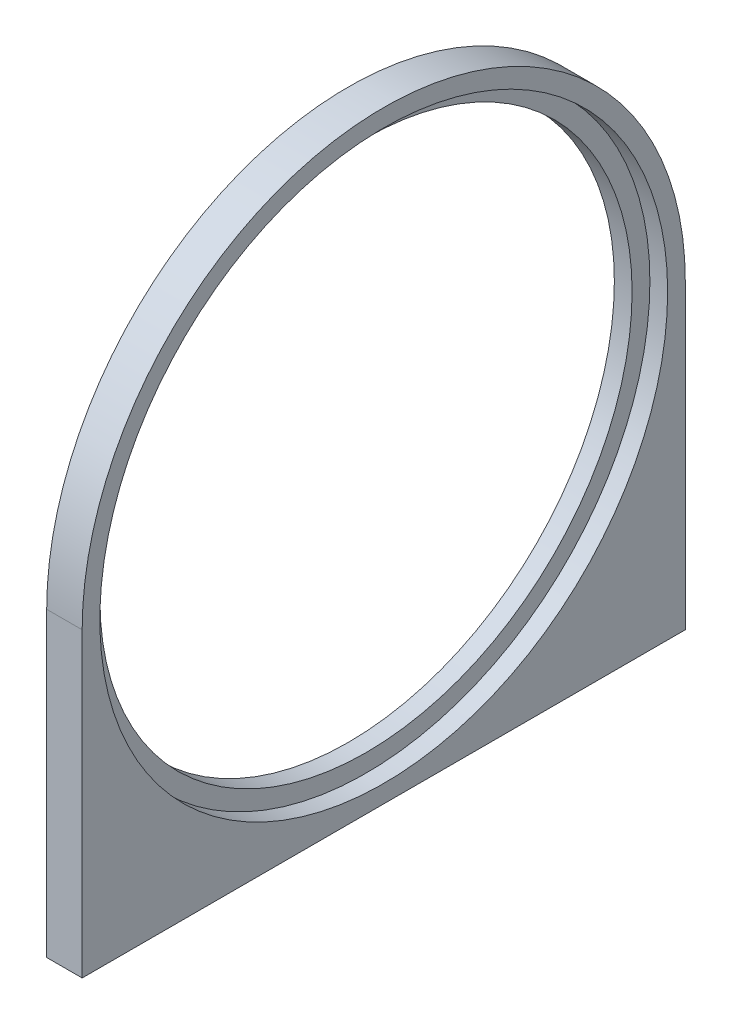
ISO-10303-21;
HEADER;
FILE_DESCRIPTION(('STEP AP214'),'2;1');
FILE_NAME('part.step','',(''),(''),'','','');
FILE_SCHEMA(('AUTOMOTIVE_DESIGN { 1 0 10303 214 1 1 1 1 }'));
ENDSEC;
DATA;
#1=APPLICATION_CONTEXT('core data for automotive mechanical design processes');
#2=APPLICATION_PROTOCOL_DEFINITION('international standard','automotive_design',2000,#1);
#3=PRODUCT_CONTEXT('',#1,'mechanical');
#4=PRODUCT('Part','Part','',(#3));
#5=PRODUCT_RELATED_PRODUCT_CATEGORY('part','',(#4));
#6=PRODUCT_DEFINITION_FORMATION('','',#4);
#7=PRODUCT_DEFINITION_CONTEXT('part definition',#1,'design');
#8=PRODUCT_DEFINITION('design','',#6,#7);
#9=PRODUCT_DEFINITION_SHAPE('','',#8);
#10=(LENGTH_UNIT() NAMED_UNIT(*) SI_UNIT(.MILLI.,.METRE.));
#11=(NAMED_UNIT(*) PLANE_ANGLE_UNIT() SI_UNIT($,.RADIAN.));
#12=(NAMED_UNIT(*) SI_UNIT($,.STERADIAN.) SOLID_ANGLE_UNIT());
#13=UNCERTAINTY_MEASURE_WITH_UNIT(LENGTH_MEASURE(1.E-05),#10,'distance_accuracy_value','');
#14=(GEOMETRIC_REPRESENTATION_CONTEXT(3) GLOBAL_UNCERTAINTY_ASSIGNED_CONTEXT((#13)) GLOBAL_UNIT_ASSIGNED_CONTEXT((#10,
#11,#12)) REPRESENTATION_CONTEXT('',''));
#15=CARTESIAN_POINT('',(0.,0.,0.));
#16=DIRECTION('',(0.,0.,1.));
#17=DIRECTION('',(1.,0.,0.));
#18=AXIS2_PLACEMENT_3D('',#15,#16,#17);
#19=CARTESIAN_POINT('',(6.35,0.,-53.975));
#20=DIRECTION('',(0.,0.,1.));
#21=DIRECTION('',(1.,0.,0.));
#22=AXIS2_PLACEMENT_3D('',#19,#20,#21);
#23=PLANE('',#22);
#24=DIRECTION('',(0.,1.,0.));
#25=VECTOR('',#24,1.);
#26=CARTESIAN_POINT('',(0.,0.,-53.975));
#27=LINE('',#26,#25);
#28=CARTESIAN_POINT('',(0.,-53.975,-53.975));
#29=VERTEX_POINT('',#28);
#30=CARTESIAN_POINT('',(0.,0.,-53.975));
#31=VERTEX_POINT('',#30);
#32=EDGE_CURVE('E137',#29,#31,#27,.T.);
#33=ORIENTED_EDGE('',*,*,#32,.T.);
#34=DIRECTION('',(-1.,0.,0.));
#35=VECTOR('',#34,1.);
#36=CARTESIAN_POINT('',(6.35,0.,-53.975));
#37=LINE('',#36,#35);
#38=CARTESIAN_POINT('',(6.35,0.,-53.975));
#39=VERTEX_POINT('',#38);
#40=EDGE_CURVE('E47',#39,#31,#37,.T.);
#41=ORIENTED_EDGE('',*,*,#40,.F.);
#42=DIRECTION('',(0.,1.,0.));
#43=VECTOR('',#42,1.);
#44=CARTESIAN_POINT('',(6.35,0.,-53.975));
#45=LINE('',#44,#43);
#46=CARTESIAN_POINT('',(6.35,-53.975,-53.975));
#47=VERTEX_POINT('',#46);
#48=EDGE_CURVE('E143',#47,#39,#45,.T.);
#49=ORIENTED_EDGE('',*,*,#48,.F.);
#50=DIRECTION('',(-1.,0.,0.));
#51=VECTOR('',#50,1.);
#52=CARTESIAN_POINT('',(6.35,-53.975,-53.975));
#53=LINE('',#52,#51);
#54=EDGE_CURVE('E149',#47,#29,#53,.T.);
#55=ORIENTED_EDGE('',*,*,#54,.T.);
#56=EDGE_LOOP('',(#33,#41,#49,#55));
#57=FACE_BOUND('',#56,.T.);
#58=ADVANCED_FACE('F38',(#57),#23,.F.);
#59=CARTESIAN_POINT('',(6.35,0.,0.));
#60=DIRECTION('',(-1.,0.,0.));
#61=DIRECTION('',(0.,0.,1.));
#62=AXIS2_PLACEMENT_3D('',#59,#60,#61);
#63=CYLINDRICAL_SURFACE('',#62,53.975);
#64=CARTESIAN_POINT('',(0.,0.,0.));
#65=DIRECTION('',(1.,0.,0.));
#66=DIRECTION('',(0.,0.,-1.));
#67=AXIS2_PLACEMENT_3D('',#64,#65,#66);
#68=CIRCLE('',#67,53.975);
#69=CARTESIAN_POINT('',(0.,0.,53.975));
#70=VERTEX_POINT('',#69);
#71=EDGE_CURVE('E152',#31,#70,#68,.T.);
#72=ORIENTED_EDGE('',*,*,#71,.T.);
#73=DIRECTION('',(-1.,0.,0.));
#74=VECTOR('',#73,1.);
#75=CARTESIAN_POINT('',(6.35,0.,53.975));
#76=LINE('',#75,#74);
#77=CARTESIAN_POINT('',(6.35,0.,53.975));
#78=VERTEX_POINT('',#77);
#79=EDGE_CURVE('E159',#78,#70,#76,.T.);
#80=ORIENTED_EDGE('',*,*,#79,.F.);
#81=CARTESIAN_POINT('',(6.35,0.,0.));
#82=DIRECTION('',(1.,0.,0.));
#83=DIRECTION('',(0.,0.,-1.));
#84=AXIS2_PLACEMENT_3D('',#81,#82,#83);
#85=CIRCLE('',#84,53.975);
#86=EDGE_CURVE('E87',#39,#78,#85,.T.);
#87=ORIENTED_EDGE('',*,*,#86,.F.);
#88=ORIENTED_EDGE('',*,*,#40,.T.);
#89=EDGE_LOOP('',(#72,#80,#87,#88));
#90=FACE_BOUND('',#89,.T.);
#91=ADVANCED_FACE('F161',(#90),#63,.T.);
#92=CARTESIAN_POINT('',(6.35,0.,53.975));
#93=DIRECTION('',(0.,0.,-1.));
#94=DIRECTION('',(-1.,0.,0.));
#95=AXIS2_PLACEMENT_3D('',#92,#93,#94);
#96=PLANE('',#95);
#97=DIRECTION('',(0.,-1.,0.));
#98=VECTOR('',#97,1.);
#99=CARTESIAN_POINT('',(0.,0.,53.975));
#100=LINE('',#99,#98);
#101=CARTESIAN_POINT('',(0.,-53.975,53.975));
#102=VERTEX_POINT('',#101);
#103=EDGE_CURVE('E73',#70,#102,#100,.T.);
#104=ORIENTED_EDGE('',*,*,#103,.T.);
#105=DIRECTION('',(-1.,0.,0.));
#106=VECTOR('',#105,1.);
#107=CARTESIAN_POINT('',(6.35,-53.975,53.975));
#108=LINE('',#107,#106);
#109=CARTESIAN_POINT('',(6.35,-53.975,53.975));
#110=VERTEX_POINT('',#109);
#111=EDGE_CURVE('E157',#110,#102,#108,.T.);
#112=ORIENTED_EDGE('',*,*,#111,.F.);
#113=DIRECTION('',(0.,-1.,0.));
#114=VECTOR('',#113,1.);
#115=CARTESIAN_POINT('',(6.35,0.,53.975));
#116=LINE('',#115,#114);
#117=EDGE_CURVE('E146',#78,#110,#116,.T.);
#118=ORIENTED_EDGE('',*,*,#117,.F.);
#119=ORIENTED_EDGE('',*,*,#79,.T.);
#120=EDGE_LOOP('',(#104,#112,#118,#119));
#121=FACE_BOUND('',#120,.T.);
#122=ADVANCED_FACE('F189',(#121),#96,.F.);
#123=CARTESIAN_POINT('',(6.35,0.,0.));
#124=DIRECTION('',(-1.,0.,0.));
#125=DIRECTION('',(0.,0.,1.));
#126=AXIS2_PLACEMENT_3D('',#123,#124,#125);
#127=CYLINDRICAL_SURFACE('',#126,50.8127);
#128=CARTESIAN_POINT('',(3.175,0.,0.));
#129=DIRECTION('',(1.,0.,0.));
#130=DIRECTION('',(0.,0.,-1.));
#131=AXIS2_PLACEMENT_3D('',#128,#129,#130);
#132=CIRCLE('',#131,50.8127);
#133=CARTESIAN_POINT('',(3.175,0.,-50.8127));
#134=VERTEX_POINT('',#133);
#135=EDGE_CURVE('E11',#134,#134,#132,.T.);
#136=ORIENTED_EDGE('',*,*,#135,.F.);
#137=EDGE_LOOP('',(#136));
#138=FACE_BOUND('',#137,.T.);
#139=CARTESIAN_POINT('',(6.35,0.,0.));
#140=DIRECTION('',(1.,0.,0.));
#141=DIRECTION('',(0.,0.,-1.));
#142=AXIS2_PLACEMENT_3D('',#139,#140,#141);
#143=CIRCLE('',#142,50.8127);
#144=CARTESIAN_POINT('',(6.35,0.,-50.8127));
#145=VERTEX_POINT('',#144);
#146=EDGE_CURVE('E140',#145,#145,#143,.T.);
#147=ORIENTED_EDGE('',*,*,#146,.T.);
#148=EDGE_LOOP('',(#147));
#149=FACE_BOUND('',#148,.T.);
#150=ADVANCED_FACE('F40',(#138,#149),#127,.F.);
#151=CARTESIAN_POINT('',(6.35,-53.975,0.));
#152=DIRECTION('',(0.,1.,0.));
#153=DIRECTION('',(0.,0.,1.));
#154=AXIS2_PLACEMENT_3D('',#151,#152,#153);
#155=PLANE('',#154);
#156=CARTESIAN_POINT('',(3.175,-53.975,-44.45));
#157=DIRECTION('',(0.,-1.,0.));
#158=DIRECTION('',(0.,0.,-1.));
#159=AXIS2_PLACEMENT_3D('',#156,#157,#158);
#160=CIRCLE('',#159,1.7272);
#161=CARTESIAN_POINT('',(3.175,-53.975,-46.1772));
#162=VERTEX_POINT('',#161);
#163=EDGE_CURVE('E111',#162,#162,#160,.T.);
#164=ORIENTED_EDGE('',*,*,#163,.F.);
#165=EDGE_LOOP('',(#164));
#166=FACE_BOUND('',#165,.T.);
#167=CARTESIAN_POINT('',(3.175,-53.975,-25.4));
#168=DIRECTION('',(0.,-1.,0.));
#169=DIRECTION('',(0.,0.,-1.));
#170=AXIS2_PLACEMENT_3D('',#167,#168,#169);
#171=CIRCLE('',#170,1.7272);
#172=CARTESIAN_POINT('',(3.175,-53.975,-27.1272));
#173=VERTEX_POINT('',#172);
#174=EDGE_CURVE('E110',#173,#173,#171,.T.);
#175=ORIENTED_EDGE('',*,*,#174,.F.);
#176=EDGE_LOOP('',(#175));
#177=FACE_BOUND('',#176,.T.);
#178=CARTESIAN_POINT('',(3.17499999999999,-53.975,25.4));
#179=DIRECTION('',(0.,-1.,0.));
#180=DIRECTION('',(0.,0.,-1.));
#181=AXIS2_PLACEMENT_3D('',#178,#179,#180);
#182=CIRCLE('',#181,1.7272);
#183=CARTESIAN_POINT('',(3.17499999999999,-53.975,23.6728));
#184=VERTEX_POINT('',#183);
#185=EDGE_CURVE('E121',#184,#184,#182,.T.);
#186=ORIENTED_EDGE('',*,*,#185,.F.);
#187=EDGE_LOOP('',(#186));
#188=FACE_BOUND('',#187,.T.);
#189=CARTESIAN_POINT('',(3.17499999999999,-53.975,44.45));
#190=DIRECTION('',(0.,-1.,0.));
#191=DIRECTION('',(0.,0.,-1.));
#192=AXIS2_PLACEMENT_3D('',#189,#190,#191);
#193=CIRCLE('',#192,1.7272);
#194=CARTESIAN_POINT('',(3.17499999999999,-53.975,42.7228));
#195=VERTEX_POINT('',#194);
#196=EDGE_CURVE('E127',#195,#195,#193,.T.);
#197=ORIENTED_EDGE('',*,*,#196,.F.);
#198=EDGE_LOOP('',(#197));
#199=FACE_BOUND('',#198,.T.);
#200=DIRECTION('',(0.,0.,-1.));
#201=VECTOR('',#200,1.);
#202=CARTESIAN_POINT('',(0.,-53.975,0.));
#203=LINE('',#202,#201);
#204=EDGE_CURVE('E79',#102,#29,#203,.T.);
#205=ORIENTED_EDGE('',*,*,#204,.T.);
#206=ORIENTED_EDGE('',*,*,#54,.F.);
#207=DIRECTION('',(0.,0.,-1.));
#208=VECTOR('',#207,1.);
#209=CARTESIAN_POINT('',(6.35,-53.975,0.));
#210=LINE('',#209,#208);
#211=EDGE_CURVE('E55',#110,#47,#210,.T.);
#212=ORIENTED_EDGE('',*,*,#211,.F.);
#213=ORIENTED_EDGE('',*,*,#111,.T.);
#214=EDGE_LOOP('',(#205,#206,#212,#213));
#215=FACE_BOUND('',#214,.T.);
#216=ADVANCED_FACE('F194',(#166,#177,#188,#199,#215),#155,.F.);
#217=CARTESIAN_POINT('',(6.35,0.,0.));
#218=DIRECTION('',(1.,0.,0.));
#219=DIRECTION('',(0.,0.,-1.));
#220=AXIS2_PLACEMENT_3D('',#217,#218,#219);
#221=PLANE('',#220);
#222=ORIENTED_EDGE('',*,*,#146,.F.);
#223=EDGE_LOOP('',(#222));
#224=FACE_BOUND('',#223,.T.);
#225=ORIENTED_EDGE('',*,*,#48,.T.);
#226=ORIENTED_EDGE('',*,*,#86,.T.);
#227=ORIENTED_EDGE('',*,*,#117,.T.);
#228=ORIENTED_EDGE('',*,*,#211,.T.);
#229=EDGE_LOOP('',(#225,#226,#227,#228));
#230=FACE_BOUND('',#229,.T.);
#231=ADVANCED_FACE('F170',(#224,#230),#221,.T.);
#232=CARTESIAN_POINT('',(0.,0.,0.));
#233=DIRECTION('',(1.,0.,0.));
#234=DIRECTION('',(0.,0.,-1.));
#235=AXIS2_PLACEMENT_3D('',#232,#233,#234);
#236=PLANE('',#235);
#237=ORIENTED_EDGE('',*,*,#32,.F.);
#238=ORIENTED_EDGE('',*,*,#204,.F.);
#239=ORIENTED_EDGE('',*,*,#103,.F.);
#240=ORIENTED_EDGE('',*,*,#71,.F.);
#241=EDGE_LOOP('',(#237,#238,#239,#240));
#242=FACE_BOUND('',#241,.T.);
#243=CARTESIAN_POINT('',(0.,0.,0.));
#244=DIRECTION('',(1.,0.,0.));
#245=DIRECTION('',(0.,0.,-1.));
#246=AXIS2_PLACEMENT_3D('',#243,#244,#245);
#247=CIRCLE('',#246,47.625);
#248=CARTESIAN_POINT('',(0.,0.,-47.625));
#249=VERTEX_POINT('',#248);
#250=EDGE_CURVE('E133',#249,#249,#247,.T.);
#251=ORIENTED_EDGE('',*,*,#250,.T.);
#252=EDGE_LOOP('',(#251));
#253=FACE_BOUND('',#252,.T.);
#254=ADVANCED_FACE('F166',(#242,#253),#236,.F.);
#255=CARTESIAN_POINT('',(3.175,0.,0.));
#256=DIRECTION('',(-1.,0.,0.));
#257=DIRECTION('',(0.,0.,1.));
#258=AXIS2_PLACEMENT_3D('',#255,#256,#257);
#259=CYLINDRICAL_SURFACE('',#258,47.625);
#260=CARTESIAN_POINT('',(3.175,0.,0.));
#261=DIRECTION('',(1.,0.,0.));
#262=DIRECTION('',(0.,0.,-1.));
#263=AXIS2_PLACEMENT_3D('',#260,#261,#262);
#264=CIRCLE('',#263,47.625);
#265=CARTESIAN_POINT('',(3.175,0.,-47.625));
#266=VERTEX_POINT('',#265);
#267=EDGE_CURVE('E134',#266,#266,#264,.T.);
#268=ORIENTED_EDGE('',*,*,#267,.T.);
#269=EDGE_LOOP('',(#268));
#270=FACE_BOUND('',#269,.T.);
#271=ORIENTED_EDGE('',*,*,#250,.F.);
#272=EDGE_LOOP('',(#271));
#273=FACE_BOUND('',#272,.T.);
#274=ADVANCED_FACE('F169',(#270,#273),#259,.F.);
#275=CARTESIAN_POINT('',(3.175,0.,0.));
#276=DIRECTION('',(1.,0.,0.));
#277=DIRECTION('',(0.,0.,-1.));
#278=AXIS2_PLACEMENT_3D('',#275,#276,#277);
#279=PLANE('',#278);
#280=ORIENTED_EDGE('',*,*,#267,.F.);
#281=EDGE_LOOP('',(#280));
#282=FACE_BOUND('',#281,.T.);
#283=ORIENTED_EDGE('',*,*,#135,.T.);
#284=EDGE_LOOP('',(#283));
#285=FACE_BOUND('',#284,.T.);
#286=ADVANCED_FACE('F175',(#282,#285),#279,.T.);
#287=CARTESIAN_POINT('',(3.17499999999999,-47.625,44.45));
#288=DIRECTION('',(0.,-1.,0.));
#289=DIRECTION('',(0.,0.,-1.));
#290=AXIS2_PLACEMENT_3D('',#287,#288,#289);
#291=CONICAL_SURFACE('',#290,1.7272,1.02974425867665);
#292=CARTESIAN_POINT('',(3.17499999999999,-46.5871935388156,44.45));
#293=VERTEX_POINT('',#292);
#294=VERTEX_LOOP('',#293);
#295=FACE_BOUND('',#294,.T.);
#296=CARTESIAN_POINT('',(3.17499999999999,-47.625,44.45));
#297=DIRECTION('',(0.,-1.,0.));
#298=DIRECTION('',(0.,0.,-1.));
#299=AXIS2_PLACEMENT_3D('',#296,#297,#298);
#300=CIRCLE('',#299,1.7272);
#301=CARTESIAN_POINT('',(3.17499999999999,-47.625,42.7228));
#302=VERTEX_POINT('',#301);
#303=EDGE_CURVE('E130',#302,#302,#300,.T.);
#304=ORIENTED_EDGE('',*,*,#303,.T.);
#305=EDGE_LOOP('',(#304));
#306=FACE_BOUND('',#305,.T.);
#307=ADVANCED_FACE('F181',(#295,#306),#291,.F.);
#308=CARTESIAN_POINT('',(3.17499999999999,-53.975,44.45));
#309=DIRECTION('',(0.,-1.,0.));
#310=DIRECTION('',(0.,0.,-1.));
#311=AXIS2_PLACEMENT_3D('',#308,#309,#310);
#312=CYLINDRICAL_SURFACE('',#311,1.7272);
#313=ORIENTED_EDGE('',*,*,#303,.F.);
#314=EDGE_LOOP('',(#313));
#315=FACE_BOUND('',#314,.T.);
#316=ORIENTED_EDGE('',*,*,#196,.T.);
#317=EDGE_LOOP('',(#316));
#318=FACE_BOUND('',#317,.T.);
#319=ADVANCED_FACE('F230',(#315,#318),#312,.F.);
#320=CARTESIAN_POINT('',(3.17499999999999,-47.625,25.4));
#321=DIRECTION('',(0.,-1.,0.));
#322=DIRECTION('',(0.,0.,-1.));
#323=AXIS2_PLACEMENT_3D('',#320,#321,#322);
#324=CONICAL_SURFACE('',#323,1.7272,1.02974425867666);
#325=CARTESIAN_POINT('',(3.17499999999999,-46.5871935388156,25.4));
#326=VERTEX_POINT('',#325);
#327=VERTEX_LOOP('',#326);
#328=FACE_BOUND('',#327,.T.);
#329=CARTESIAN_POINT('',(3.17499999999999,-47.625,25.4));
#330=DIRECTION('',(0.,-1.,0.));
#331=DIRECTION('',(0.,0.,-1.));
#332=AXIS2_PLACEMENT_3D('',#329,#330,#331);
#333=CIRCLE('',#332,1.7272);
#334=CARTESIAN_POINT('',(3.17499999999999,-47.625,23.6728));
#335=VERTEX_POINT('',#334);
#336=EDGE_CURVE('E124',#335,#335,#333,.T.);
#337=ORIENTED_EDGE('',*,*,#336,.T.);
#338=EDGE_LOOP('',(#337));
#339=FACE_BOUND('',#338,.T.);
#340=ADVANCED_FACE('F240',(#328,#339),#324,.F.);
#341=CARTESIAN_POINT('',(3.17499999999999,-53.975,25.4));
#342=DIRECTION('',(0.,-1.,0.));
#343=DIRECTION('',(0.,0.,-1.));
#344=AXIS2_PLACEMENT_3D('',#341,#342,#343);
#345=CYLINDRICAL_SURFACE('',#344,1.7272);
#346=ORIENTED_EDGE('',*,*,#336,.F.);
#347=EDGE_LOOP('',(#346));
#348=FACE_BOUND('',#347,.T.);
#349=ORIENTED_EDGE('',*,*,#185,.T.);
#350=EDGE_LOOP('',(#349));
#351=FACE_BOUND('',#350,.T.);
#352=ADVANCED_FACE('F250',(#348,#351),#345,.F.);
#353=CARTESIAN_POINT('',(3.175,-47.625,-25.4));
#354=DIRECTION('',(0.,-1.,0.));
#355=DIRECTION('',(0.,0.,-1.));
#356=AXIS2_PLACEMENT_3D('',#353,#354,#355);
#357=CONICAL_SURFACE('',#356,1.7272,1.02974425867666);
#358=CARTESIAN_POINT('',(3.17499999999999,-46.5871935388156,-25.4));
#359=VERTEX_POINT('',#358);
#360=VERTEX_LOOP('',#359);
#361=FACE_BOUND('',#360,.T.);
#362=CARTESIAN_POINT('',(3.175,-47.625,-25.4));
#363=DIRECTION('',(0.,-1.,0.));
#364=DIRECTION('',(0.,0.,-1.));
#365=AXIS2_PLACEMENT_3D('',#362,#363,#364);
#366=CIRCLE('',#365,1.7272);
#367=CARTESIAN_POINT('',(3.175,-47.625,-27.1272));
#368=VERTEX_POINT('',#367);
#369=EDGE_CURVE('E114',#368,#368,#366,.T.);
#370=ORIENTED_EDGE('',*,*,#369,.T.);
#371=EDGE_LOOP('',(#370));
#372=FACE_BOUND('',#371,.T.);
#373=ADVANCED_FACE('F260',(#361,#372),#357,.F.);
#374=CARTESIAN_POINT('',(3.175,-53.975,-25.4));
#375=DIRECTION('',(0.,-1.,0.));
#376=DIRECTION('',(0.,0.,-1.));
#377=AXIS2_PLACEMENT_3D('',#374,#375,#376);
#378=CYLINDRICAL_SURFACE('',#377,1.7272);
#379=ORIENTED_EDGE('',*,*,#369,.F.);
#380=EDGE_LOOP('',(#379));
#381=FACE_BOUND('',#380,.T.);
#382=ORIENTED_EDGE('',*,*,#174,.T.);
#383=EDGE_LOOP('',(#382));
#384=FACE_BOUND('',#383,.T.);
#385=ADVANCED_FACE('F104',(#381,#384),#378,.F.);
#386=CARTESIAN_POINT('',(3.175,-47.625,-44.45));
#387=DIRECTION('',(0.,-1.,0.));
#388=DIRECTION('',(0.,0.,-1.));
#389=AXIS2_PLACEMENT_3D('',#386,#387,#388);
#390=CONICAL_SURFACE('',#389,1.7272,1.02974425867666);
#391=CARTESIAN_POINT('',(3.175,-46.5871935388156,-44.45));
#392=VERTEX_POINT('',#391);
#393=VERTEX_LOOP('',#392);
#394=FACE_BOUND('',#393,.T.);
#395=CARTESIAN_POINT('',(3.175,-47.625,-44.45));
#396=DIRECTION('',(0.,-1.,0.));
#397=DIRECTION('',(0.,0.,-1.));
#398=AXIS2_PLACEMENT_3D('',#395,#396,#397);
#399=CIRCLE('',#398,1.7272);
#400=CARTESIAN_POINT('',(3.175,-47.625,-46.1772));
#401=VERTEX_POINT('',#400);
#402=EDGE_CURVE('E108',#401,#401,#399,.T.);
#403=ORIENTED_EDGE('',*,*,#402,.T.);
#404=EDGE_LOOP('',(#403));
#405=FACE_BOUND('',#404,.T.);
#406=ADVANCED_FACE('F100',(#394,#405),#390,.F.);
#407=CARTESIAN_POINT('',(3.175,-53.975,-44.45));
#408=DIRECTION('',(0.,-1.,0.));
#409=DIRECTION('',(0.,0.,-1.));
#410=AXIS2_PLACEMENT_3D('',#407,#408,#409);
#411=CYLINDRICAL_SURFACE('',#410,1.7272);
#412=ORIENTED_EDGE('',*,*,#402,.F.);
#413=EDGE_LOOP('',(#412));
#414=FACE_BOUND('',#413,.T.);
#415=ORIENTED_EDGE('',*,*,#163,.T.);
#416=EDGE_LOOP('',(#415));
#417=FACE_BOUND('',#416,.T.);
#418=ADVANCED_FACE('F103',(#414,#417),#411,.F.);
#419=CLOSED_SHELL('',(#58,#91,#122,#150,#216,#231,#254,#274,#286,#307,#319,#340,#352,#373,#385,
#406,#418));
#420=MANIFOLD_SOLID_BREP('B2',#419);
#421=ADVANCED_BREP_SHAPE_REPRESENTATION('',(#18,#420),#14);
#422=SHAPE_DEFINITION_REPRESENTATION(#9,#421);
ENDSEC;
END-ISO-10303-21;
